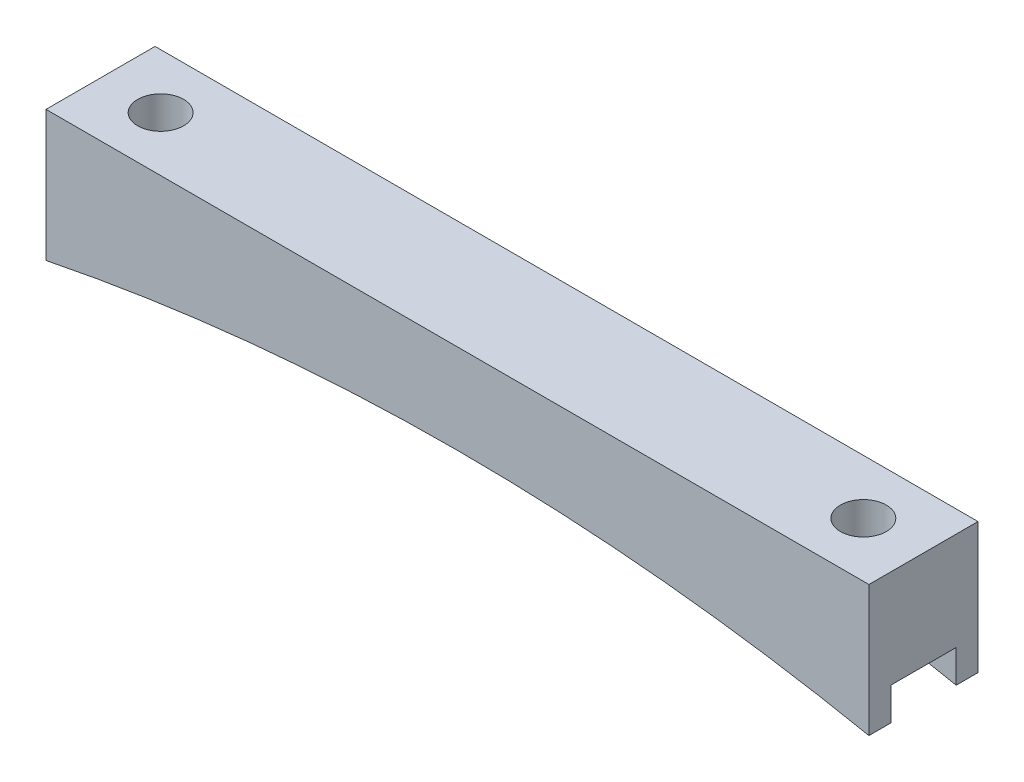
ISO-10303-21;
HEADER;
FILE_DESCRIPTION(('STEP AP214'),'2;1');
FILE_NAME('part.step','',(''),(''),'','','');
FILE_SCHEMA(('AUTOMOTIVE_DESIGN { 1 0 10303 214 1 1 1 1 }'));
ENDSEC;
DATA;
#1=APPLICATION_CONTEXT('core data for automotive mechanical design processes');
#2=APPLICATION_PROTOCOL_DEFINITION('international standard','automotive_design',2000,#1);
#3=PRODUCT_CONTEXT('',#1,'mechanical');
#4=PRODUCT('Part','Part','',(#3));
#5=PRODUCT_RELATED_PRODUCT_CATEGORY('part','',(#4));
#6=PRODUCT_DEFINITION_FORMATION('','',#4);
#7=PRODUCT_DEFINITION_CONTEXT('part definition',#1,'design');
#8=PRODUCT_DEFINITION('design','',#6,#7);
#9=PRODUCT_DEFINITION_SHAPE('','',#8);
#10=(LENGTH_UNIT() NAMED_UNIT(*) SI_UNIT(.MILLI.,.METRE.));
#11=(NAMED_UNIT(*) PLANE_ANGLE_UNIT() SI_UNIT($,.RADIAN.));
#12=(NAMED_UNIT(*) SI_UNIT($,.STERADIAN.) SOLID_ANGLE_UNIT());
#13=UNCERTAINTY_MEASURE_WITH_UNIT(LENGTH_MEASURE(1.E-05),#10,'distance_accuracy_value','');
#14=(GEOMETRIC_REPRESENTATION_CONTEXT(3) GLOBAL_UNCERTAINTY_ASSIGNED_CONTEXT((#13)) GLOBAL_UNIT_ASSIGNED_CONTEXT((#10,
#11,#12)) REPRESENTATION_CONTEXT('',''));
#15=CARTESIAN_POINT('',(0.,0.,0.));
#16=DIRECTION('',(0.,0.,1.));
#17=DIRECTION('',(1.,0.,0.));
#18=AXIS2_PLACEMENT_3D('',#15,#16,#17);
#19=CARTESIAN_POINT('',(47.915,0.,12.7));
#20=DIRECTION('',(-1.,0.,0.));
#21=DIRECTION('',(0.,0.,1.));
#22=AXIS2_PLACEMENT_3D('',#19,#20,#21);
#23=PLANE('',#22);
#24=DIRECTION('',(0.,0.,-1.));
#25=VECTOR('',#24,1.);
#26=CARTESIAN_POINT('',(47.915,-15.2399999999999,12.7));
#27=LINE('',#26,#25);
#28=CARTESIAN_POINT('',(47.915,-15.2399999999999,12.7));
#29=VERTEX_POINT('',#28);
#30=CARTESIAN_POINT('',(47.915,-15.24,10.16));
#31=VERTEX_POINT('',#30);
#32=EDGE_CURVE('E156',#29,#31,#27,.T.);
#33=ORIENTED_EDGE('',*,*,#32,.T.);
#34=DIRECTION('',(0.,-1.,0.));
#35=VECTOR('',#34,1.);
#36=CARTESIAN_POINT('',(47.915,-15.24,10.16));
#37=LINE('',#36,#35);
#38=CARTESIAN_POINT('',(47.915,-11.43,10.16));
#39=VERTEX_POINT('',#38);
#40=EDGE_CURVE('E185',#39,#31,#37,.T.);
#41=ORIENTED_EDGE('',*,*,#40,.F.);
#42=DIRECTION('',(0.,0.,1.));
#43=VECTOR('',#42,1.);
#44=CARTESIAN_POINT('',(47.915,-11.43,10.16));
#45=LINE('',#44,#43);
#46=CARTESIAN_POINT('',(47.915,-11.43,2.54));
#47=VERTEX_POINT('',#46);
#48=EDGE_CURVE('E141',#47,#39,#45,.T.);
#49=ORIENTED_EDGE('',*,*,#48,.F.);
#50=DIRECTION('',(0.,1.,0.));
#51=VECTOR('',#50,1.);
#52=CARTESIAN_POINT('',(47.915,-15.24,2.54));
#53=LINE('',#52,#51);
#54=CARTESIAN_POINT('',(47.915,-15.24,2.54));
#55=VERTEX_POINT('',#54);
#56=EDGE_CURVE('E177',#55,#47,#53,.T.);
#57=ORIENTED_EDGE('',*,*,#56,.F.);
#58=CARTESIAN_POINT('',(47.915,-15.2399999999999,0.));
#59=VERTEX_POINT('',#58);
#60=EDGE_CURVE('E174',#55,#59,#27,.T.);
#61=ORIENTED_EDGE('',*,*,#60,.T.);
#62=DIRECTION('',(0.,1.,0.));
#63=VECTOR('',#62,1.);
#64=CARTESIAN_POINT('',(47.915,0.,0.));
#65=LINE('',#64,#63);
#66=CARTESIAN_POINT('',(47.915,0.,0.));
#67=VERTEX_POINT('',#66);
#68=EDGE_CURVE('E213',#59,#67,#65,.T.);
#69=ORIENTED_EDGE('',*,*,#68,.T.);
#70=DIRECTION('',(0.,0.,-1.));
#71=VECTOR('',#70,1.);
#72=CARTESIAN_POINT('',(47.915,0.,12.7));
#73=LINE('',#72,#71);
#74=CARTESIAN_POINT('',(47.915,0.,12.7));
#75=VERTEX_POINT('',#74);
#76=EDGE_CURVE('E154',#75,#67,#73,.T.);
#77=ORIENTED_EDGE('',*,*,#76,.F.);
#78=DIRECTION('',(0.,1.,0.));
#79=VECTOR('',#78,1.);
#80=CARTESIAN_POINT('',(47.915,0.,12.7));
#81=LINE('',#80,#79);
#82=EDGE_CURVE('E217',#29,#75,#81,.T.);
#83=ORIENTED_EDGE('',*,*,#82,.F.);
#84=EDGE_LOOP('',(#33,#41,#49,#57,#61,#69,#77,#83));
#85=FACE_BOUND('',#84,.T.);
#86=ADVANCED_FACE('F43',(#85),#23,.F.);
#87=CARTESIAN_POINT('',(-47.915,0.,12.7));
#88=DIRECTION('',(0.,-1.,0.));
#89=DIRECTION('',(1.,0.,0.));
#90=AXIS2_PLACEMENT_3D('',#87,#88,#89);
#91=PLANE('',#90);
#92=CARTESIAN_POINT('',(-40.915,0.,6.35));
#93=DIRECTION('',(0.,1.,0.));
#94=DIRECTION('',(-1.,0.,0.));
#95=AXIS2_PLACEMENT_3D('',#92,#93,#94);
#96=CIRCLE('',#95,2.675);
#97=CARTESIAN_POINT('',(-43.59,0.,6.35));
#98=VERTEX_POINT('',#97);
#99=EDGE_CURVE('E209',#98,#98,#96,.T.);
#100=ORIENTED_EDGE('',*,*,#99,.F.);
#101=EDGE_LOOP('',(#100));
#102=FACE_BOUND('',#101,.T.);
#103=CARTESIAN_POINT('',(40.915,0.,6.35));
#104=DIRECTION('',(0.,1.,0.));
#105=DIRECTION('',(-1.,0.,0.));
#106=AXIS2_PLACEMENT_3D('',#103,#104,#105);
#107=CIRCLE('',#106,2.675);
#108=CARTESIAN_POINT('',(38.24,0.,6.35));
#109=VERTEX_POINT('',#108);
#110=EDGE_CURVE('E208',#109,#109,#107,.T.);
#111=ORIENTED_EDGE('',*,*,#110,.F.);
#112=EDGE_LOOP('',(#111));
#113=FACE_BOUND('',#112,.T.);
#114=DIRECTION('',(-1.,0.,0.));
#115=VECTOR('',#114,1.);
#116=CARTESIAN_POINT('',(-47.915,0.,0.));
#117=LINE('',#116,#115);
#118=CARTESIAN_POINT('',(-47.915,0.,0.));
#119=VERTEX_POINT('',#118);
#120=EDGE_CURVE('E232',#67,#119,#117,.T.);
#121=ORIENTED_EDGE('',*,*,#120,.T.);
#122=DIRECTION('',(0.,0.,-1.));
#123=VECTOR('',#122,1.);
#124=CARTESIAN_POINT('',(-47.915,0.,12.7));
#125=LINE('',#124,#123);
#126=CARTESIAN_POINT('',(-47.915,0.,12.7));
#127=VERTEX_POINT('',#126);
#128=EDGE_CURVE('E148',#127,#119,#125,.T.);
#129=ORIENTED_EDGE('',*,*,#128,.F.);
#130=DIRECTION('',(-1.,0.,0.));
#131=VECTOR('',#130,1.);
#132=CARTESIAN_POINT('',(-47.915,0.,12.7));
#133=LINE('',#132,#131);
#134=EDGE_CURVE('E221',#75,#127,#133,.T.);
#135=ORIENTED_EDGE('',*,*,#134,.F.);
#136=ORIENTED_EDGE('',*,*,#76,.T.);
#137=EDGE_LOOP('',(#121,#129,#135,#136));
#138=FACE_BOUND('',#137,.T.);
#139=ADVANCED_FACE('F247',(#102,#113,#138),#91,.F.);
#140=CARTESIAN_POINT('',(-47.915,0.,12.7));
#141=DIRECTION('',(1.,0.,0.));
#142=DIRECTION('',(0.,0.,-1.));
#143=AXIS2_PLACEMENT_3D('',#140,#141,#142);
#144=PLANE('',#143);
#145=DIRECTION('',(0.,0.,1.));
#146=VECTOR('',#145,1.);
#147=CARTESIAN_POINT('',(-47.915,-11.43,10.16));
#148=LINE('',#147,#146);
#149=CARTESIAN_POINT('',(-47.915,-11.43,2.54));
#150=VERTEX_POINT('',#149);
#151=CARTESIAN_POINT('',(-47.915,-11.43,10.16));
#152=VERTEX_POINT('',#151);
#153=EDGE_CURVE('E139',#150,#152,#148,.T.);
#154=ORIENTED_EDGE('',*,*,#153,.T.);
#155=DIRECTION('',(0.,-1.,0.));
#156=VECTOR('',#155,1.);
#157=CARTESIAN_POINT('',(-47.915,-15.24,10.16));
#158=LINE('',#157,#156);
#159=CARTESIAN_POINT('',(-47.915,-15.24,10.16));
#160=VERTEX_POINT('',#159);
#161=EDGE_CURVE('E124',#152,#160,#158,.T.);
#162=ORIENTED_EDGE('',*,*,#161,.T.);
#163=DIRECTION('',(0.,0.,-1.));
#164=VECTOR('',#163,1.);
#165=CARTESIAN_POINT('',(-47.915,-15.24,12.7));
#166=LINE('',#165,#164);
#167=CARTESIAN_POINT('',(-47.915,-15.24,12.7));
#168=VERTEX_POINT('',#167);
#169=EDGE_CURVE('E136',#168,#160,#166,.T.);
#170=ORIENTED_EDGE('',*,*,#169,.F.);
#171=DIRECTION('',(0.,-1.,0.));
#172=VECTOR('',#171,1.);
#173=CARTESIAN_POINT('',(-47.915,0.,12.7));
#174=LINE('',#173,#172);
#175=EDGE_CURVE('E225',#127,#168,#174,.T.);
#176=ORIENTED_EDGE('',*,*,#175,.F.);
#177=ORIENTED_EDGE('',*,*,#128,.T.);
#178=DIRECTION('',(0.,-1.,0.));
#179=VECTOR('',#178,1.);
#180=CARTESIAN_POINT('',(-47.915,0.,0.));
#181=LINE('',#180,#179);
#182=CARTESIAN_POINT('',(-47.915,-15.24,0.));
#183=VERTEX_POINT('',#182);
#184=EDGE_CURVE('E235',#119,#183,#181,.T.);
#185=ORIENTED_EDGE('',*,*,#184,.T.);
#186=CARTESIAN_POINT('',(-47.915,-15.24,2.54));
#187=VERTEX_POINT('',#186);
#188=EDGE_CURVE('E149',#187,#183,#166,.T.);
#189=ORIENTED_EDGE('',*,*,#188,.F.);
#190=DIRECTION('',(0.,1.,0.));
#191=VECTOR('',#190,1.);
#192=CARTESIAN_POINT('',(-47.915,-15.24,2.54));
#193=LINE('',#192,#191);
#194=EDGE_CURVE('E67',#187,#150,#193,.T.);
#195=ORIENTED_EDGE('',*,*,#194,.T.);
#196=EDGE_LOOP('',(#154,#162,#170,#176,#177,#185,#189,#195));
#197=FACE_BOUND('',#196,.T.);
#198=ADVANCED_FACE('F134',(#197),#144,.F.);
#199=CARTESIAN_POINT('',(0.,-251.734910674627,12.7));
#200=DIRECTION('',(0.,0.,-1.));
#201=DIRECTION('',(-1.,0.,0.));
#202=AXIS2_PLACEMENT_3D('',#199,#200,#201);
#203=CYLINDRICAL_SURFACE('',#202,241.3);
#204=DIRECTION('',(0.,0.,-1.));
#205=VECTOR('',#204,1.);
#206=CARTESIAN_POINT('',(21.8915487268344,-11.43,12.7));
#207=LINE('',#206,#205);
#208=CARTESIAN_POINT('',(21.8915487268344,-11.4300000000001,2.54));
#209=VERTEX_POINT('',#208);
#210=CARTESIAN_POINT('',(21.8915487268344,-11.43,10.16));
#211=VERTEX_POINT('',#210);
#212=EDGE_CURVE('E172',#209,#211,#207,.F.);
#213=ORIENTED_EDGE('',*,*,#212,.T.);
#214=CARTESIAN_POINT('',(0.,-251.734910674627,10.16));
#215=DIRECTION('',(0.,0.,1.));
#216=DIRECTION('',(1.,0.,0.));
#217=AXIS2_PLACEMENT_3D('',#214,#215,#216);
#218=CIRCLE('',#217,241.3);
#219=EDGE_CURVE('E11',#211,#31,#218,.F.);
#220=ORIENTED_EDGE('',*,*,#219,.T.);
#221=ORIENTED_EDGE('',*,*,#32,.F.);
#222=CARTESIAN_POINT('',(0.,-251.734910674627,12.7));
#223=DIRECTION('',(0.,0.,-1.));
#224=DIRECTION('',(-1.,0.,0.));
#225=AXIS2_PLACEMENT_3D('',#222,#223,#224);
#226=CIRCLE('',#225,241.3);
#227=EDGE_CURVE('E146',#168,#29,#226,.T.);
#228=ORIENTED_EDGE('',*,*,#227,.F.);
#229=ORIENTED_EDGE('',*,*,#169,.T.);
#230=CARTESIAN_POINT('',(-21.8915487268344,-11.43,10.16));
#231=VERTEX_POINT('',#230);
#232=EDGE_CURVE('E46',#160,#231,#218,.F.);
#233=ORIENTED_EDGE('',*,*,#232,.T.);
#234=DIRECTION('',(0.,0.,-1.));
#235=VECTOR('',#234,1.);
#236=CARTESIAN_POINT('',(-21.8915487268344,-11.43,12.7));
#237=LINE('',#236,#235);
#238=CARTESIAN_POINT('',(-21.8915487268344,-11.4300000000001,2.54));
#239=VERTEX_POINT('',#238);
#240=EDGE_CURVE('E203',#231,#239,#237,.T.);
#241=ORIENTED_EDGE('',*,*,#240,.T.);
#242=CARTESIAN_POINT('',(0.,-251.734910674627,2.54));
#243=DIRECTION('',(0.,0.,-1.));
#244=DIRECTION('',(-1.,0.,0.));
#245=AXIS2_PLACEMENT_3D('',#242,#243,#244);
#246=CIRCLE('',#245,241.3);
#247=EDGE_CURVE('E131',#239,#187,#246,.F.);
#248=ORIENTED_EDGE('',*,*,#247,.T.);
#249=ORIENTED_EDGE('',*,*,#188,.T.);
#250=CARTESIAN_POINT('',(0.,-251.734910674627,0.));
#251=DIRECTION('',(0.,0.,-1.));
#252=DIRECTION('',(-1.,0.,0.));
#253=AXIS2_PLACEMENT_3D('',#250,#251,#252);
#254=CIRCLE('',#253,241.3);
#255=EDGE_CURVE('E222',#183,#59,#254,.T.);
#256=ORIENTED_EDGE('',*,*,#255,.T.);
#257=ORIENTED_EDGE('',*,*,#60,.F.);
#258=EDGE_CURVE('E52',#55,#209,#246,.F.);
#259=ORIENTED_EDGE('',*,*,#258,.T.);
#260=EDGE_LOOP('',(#213,#220,#221,#228,#229,#233,#241,#248,#249,#256,#257,#259));
#261=FACE_BOUND('',#260,.T.);
#262=ADVANCED_FACE('F144',(#261),#203,.F.);
#263=CARTESIAN_POINT('',(0.,-251.734910674627,12.7));
#264=DIRECTION('',(0.,0.,-1.));
#265=DIRECTION('',(-1.,0.,0.));
#266=AXIS2_PLACEMENT_3D('',#263,#264,#265);
#267=PLANE('',#266);
#268=ORIENTED_EDGE('',*,*,#82,.T.);
#269=ORIENTED_EDGE('',*,*,#134,.T.);
#270=ORIENTED_EDGE('',*,*,#175,.T.);
#271=ORIENTED_EDGE('',*,*,#227,.T.);
#272=EDGE_LOOP('',(#268,#269,#270,#271));
#273=FACE_BOUND('',#272,.T.);
#274=ADVANCED_FACE('F250',(#273),#267,.F.);
#275=CARTESIAN_POINT('',(0.,-251.734910674627,0.));
#276=DIRECTION('',(0.,0.,-1.));
#277=DIRECTION('',(-1.,0.,0.));
#278=AXIS2_PLACEMENT_3D('',#275,#276,#277);
#279=PLANE('',#278);
#280=ORIENTED_EDGE('',*,*,#68,.F.);
#281=ORIENTED_EDGE('',*,*,#255,.F.);
#282=ORIENTED_EDGE('',*,*,#184,.F.);
#283=ORIENTED_EDGE('',*,*,#120,.F.);
#284=EDGE_LOOP('',(#280,#281,#282,#283));
#285=FACE_BOUND('',#284,.T.);
#286=ADVANCED_FACE('F243',(#285),#279,.T.);
#287=CARTESIAN_POINT('',(40.915,-15.24,6.35));
#288=DIRECTION('',(0.,1.,0.));
#289=DIRECTION('',(-1.,0.,0.));
#290=AXIS2_PLACEMENT_3D('',#287,#288,#289);
#291=CYLINDRICAL_SURFACE('',#290,2.675);
#292=CARTESIAN_POINT('',(40.915,-11.43,6.35));
#293=DIRECTION('',(0.,1.,0.));
#294=DIRECTION('',(0.,0.,1.));
#295=AXIS2_PLACEMENT_3D('',#292,#293,#294);
#296=CIRCLE('',#295,2.675);
#297=CARTESIAN_POINT('',(40.915,-11.43,9.025));
#298=VERTEX_POINT('',#297);
#299=EDGE_CURVE('E166',#298,#298,#296,.F.);
#300=ORIENTED_EDGE('',*,*,#299,.T.);
#301=EDGE_LOOP('',(#300));
#302=FACE_BOUND('',#301,.T.);
#303=ORIENTED_EDGE('',*,*,#110,.T.);
#304=EDGE_LOOP('',(#303));
#305=FACE_BOUND('',#304,.T.);
#306=ADVANCED_FACE('F292',(#302,#305),#291,.F.);
#307=CARTESIAN_POINT('',(-40.915,-15.24,6.35));
#308=DIRECTION('',(0.,1.,0.));
#309=DIRECTION('',(-1.,0.,0.));
#310=AXIS2_PLACEMENT_3D('',#307,#308,#309);
#311=CYLINDRICAL_SURFACE('',#310,2.675);
#312=CARTESIAN_POINT('',(-40.915,-11.43,6.35));
#313=DIRECTION('',(0.,1.,0.));
#314=DIRECTION('',(0.,0.,1.));
#315=AXIS2_PLACEMENT_3D('',#312,#313,#314);
#316=CIRCLE('',#315,2.675);
#317=CARTESIAN_POINT('',(-40.915,-11.43,9.025));
#318=VERTEX_POINT('',#317);
#319=EDGE_CURVE('E163',#318,#318,#316,.F.);
#320=ORIENTED_EDGE('',*,*,#319,.T.);
#321=EDGE_LOOP('',(#320));
#322=FACE_BOUND('',#321,.T.);
#323=ORIENTED_EDGE('',*,*,#99,.T.);
#324=EDGE_LOOP('',(#323));
#325=FACE_BOUND('',#324,.T.);
#326=ADVANCED_FACE('F274',(#322,#325),#311,.F.);
#327=CARTESIAN_POINT('',(-47.915,-11.43,10.16));
#328=DIRECTION('',(0.,1.,0.));
#329=DIRECTION('',(0.,0.,1.));
#330=AXIS2_PLACEMENT_3D('',#327,#328,#329);
#331=PLANE('',#330);
#332=ORIENTED_EDGE('',*,*,#319,.F.);
#333=EDGE_LOOP('',(#332));
#334=FACE_BOUND('',#333,.T.);
#335=DIRECTION('',(1.,0.,0.));
#336=VECTOR('',#335,1.);
#337=CARTESIAN_POINT('',(-47.915,-11.43,10.16));
#338=LINE('',#337,#336);
#339=EDGE_CURVE('E126',#152,#231,#338,.T.);
#340=ORIENTED_EDGE('',*,*,#339,.F.);
#341=ORIENTED_EDGE('',*,*,#153,.F.);
#342=DIRECTION('',(1.,0.,0.));
#343=VECTOR('',#342,1.);
#344=CARTESIAN_POINT('',(-47.915,-11.43,2.54));
#345=LINE('',#344,#343);
#346=EDGE_CURVE('E196',#150,#239,#345,.T.);
#347=ORIENTED_EDGE('',*,*,#346,.T.);
#348=ORIENTED_EDGE('',*,*,#240,.F.);
#349=EDGE_LOOP('',(#340,#341,#347,#348));
#350=FACE_BOUND('',#349,.T.);
#351=ADVANCED_FACE('F266',(#334,#350),#331,.F.);
#352=CARTESIAN_POINT('',(-47.915,-15.24,2.54));
#353=DIRECTION('',(0.,0.,-1.));
#354=DIRECTION('',(-1.,0.,0.));
#355=AXIS2_PLACEMENT_3D('',#352,#353,#354);
#356=PLANE('',#355);
#357=ORIENTED_EDGE('',*,*,#346,.F.);
#358=ORIENTED_EDGE('',*,*,#194,.F.);
#359=ORIENTED_EDGE('',*,*,#247,.F.);
#360=EDGE_LOOP('',(#357,#358,#359));
#361=FACE_BOUND('',#360,.T.);
#362=ADVANCED_FACE('F271',(#361),#356,.F.);
#363=CARTESIAN_POINT('',(-47.915,-15.24,10.16));
#364=DIRECTION('',(0.,0.,1.));
#365=DIRECTION('',(1.,0.,0.));
#366=AXIS2_PLACEMENT_3D('',#363,#364,#365);
#367=PLANE('',#366);
#368=ORIENTED_EDGE('',*,*,#161,.F.);
#369=ORIENTED_EDGE('',*,*,#339,.T.);
#370=ORIENTED_EDGE('',*,*,#232,.F.);
#371=EDGE_LOOP('',(#368,#369,#370));
#372=FACE_BOUND('',#371,.T.);
#373=ADVANCED_FACE('F123',(#372),#367,.F.);
#374=EDGE_CURVE('E195',#211,#39,#338,.T.);
#375=ORIENTED_EDGE('',*,*,#374,.T.);
#376=ORIENTED_EDGE('',*,*,#40,.T.);
#377=ORIENTED_EDGE('',*,*,#219,.F.);
#378=EDGE_LOOP('',(#375,#376,#377));
#379=FACE_BOUND('',#378,.T.);
#380=ADVANCED_FACE('F254',(#379),#367,.F.);
#381=ORIENTED_EDGE('',*,*,#56,.T.);
#382=EDGE_CURVE('E59',#209,#47,#345,.T.);
#383=ORIENTED_EDGE('',*,*,#382,.F.);
#384=ORIENTED_EDGE('',*,*,#258,.F.);
#385=EDGE_LOOP('',(#381,#383,#384));
#386=FACE_BOUND('',#385,.T.);
#387=ADVANCED_FACE('F176',(#386),#356,.F.);
#388=ORIENTED_EDGE('',*,*,#299,.F.);
#389=EDGE_LOOP('',(#388));
#390=FACE_BOUND('',#389,.T.);
#391=ORIENTED_EDGE('',*,*,#382,.T.);
#392=ORIENTED_EDGE('',*,*,#48,.T.);
#393=ORIENTED_EDGE('',*,*,#374,.F.);
#394=ORIENTED_EDGE('',*,*,#212,.F.);
#395=EDGE_LOOP('',(#391,#392,#393,#394));
#396=FACE_BOUND('',#395,.T.);
#397=ADVANCED_FACE('F258',(#390,#396),#331,.F.);
#398=CLOSED_SHELL('',(#86,#139,#198,#262,#274,#286,#306,#326,#351,#362,#373,#380,#387,#397));
#399=MANIFOLD_SOLID_BREP('B2',#398);
#400=ADVANCED_BREP_SHAPE_REPRESENTATION('',(#18,#399),#14);
#401=SHAPE_DEFINITION_REPRESENTATION(#9,#400);
ENDSEC;
END-ISO-10303-21;
